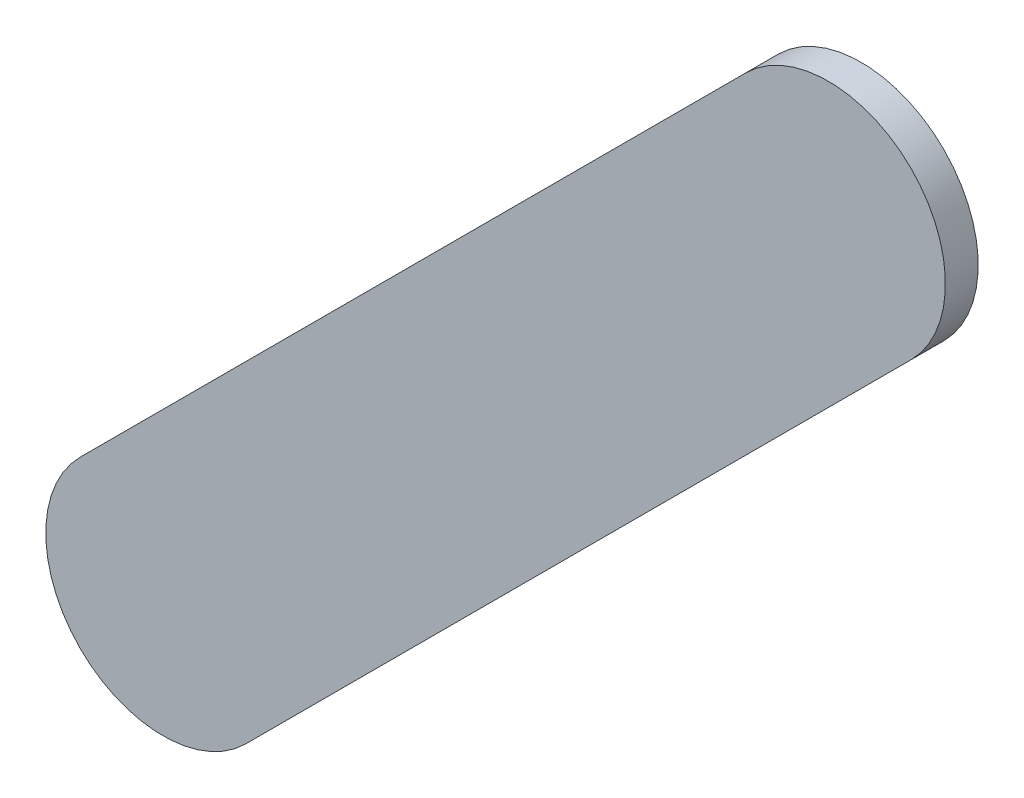
ISO-10303-21;
HEADER;
FILE_DESCRIPTION(('STEP AP214'),'2;1');
FILE_NAME('part.step','',(''),(''),'','','');
FILE_SCHEMA(('AUTOMOTIVE_DESIGN { 1 0 10303 214 1 1 1 1 }'));
ENDSEC;
DATA;
#1=APPLICATION_CONTEXT('core data for automotive mechanical design processes');
#2=APPLICATION_PROTOCOL_DEFINITION('international standard','automotive_design',2000,#1);
#3=PRODUCT_CONTEXT('',#1,'mechanical');
#4=PRODUCT('Part','Part','',(#3));
#5=PRODUCT_RELATED_PRODUCT_CATEGORY('part','',(#4));
#6=PRODUCT_DEFINITION_FORMATION('','',#4);
#7=PRODUCT_DEFINITION_CONTEXT('part definition',#1,'design');
#8=PRODUCT_DEFINITION('design','',#6,#7);
#9=PRODUCT_DEFINITION_SHAPE('','',#8);
#10=(LENGTH_UNIT() NAMED_UNIT(*) SI_UNIT(.MILLI.,.METRE.));
#11=(NAMED_UNIT(*) PLANE_ANGLE_UNIT() SI_UNIT($,.RADIAN.));
#12=(NAMED_UNIT(*) SI_UNIT($,.STERADIAN.) SOLID_ANGLE_UNIT());
#13=UNCERTAINTY_MEASURE_WITH_UNIT(LENGTH_MEASURE(1.E-05),#10,'distance_accuracy_value','');
#14=(GEOMETRIC_REPRESENTATION_CONTEXT(3) GLOBAL_UNCERTAINTY_ASSIGNED_CONTEXT((#13)) GLOBAL_UNIT_ASSIGNED_CONTEXT((#10,
#11,#12)) REPRESENTATION_CONTEXT('',''));
#15=CARTESIAN_POINT('',(0.,0.,0.));
#16=DIRECTION('',(0.,0.,1.));
#17=DIRECTION('',(1.,0.,0.));
#18=AXIS2_PLACEMENT_3D('',#15,#16,#17);
#19=CARTESIAN_POINT('',(96.28475028,57.12518674,0.));
#20=DIRECTION('',(-0.707108024981541,0.707105537389366,0.));
#21=DIRECTION('',(0.707105537389366,0.707108024981541,0.));
#22=AXIS2_PLACEMENT_3D('',#19,#20,#21);
#23=PLANE('',#22);
#24=DIRECTION('',(0.707105537389366,0.707108024981541,0.));
#25=VECTOR('',#24,1.);
#26=CARTESIAN_POINT('',(96.28475028,57.12518674,0.03556));
#27=LINE('',#26,#25);
#28=CARTESIAN_POINT('',(96.28475028,57.12518674,0.03556));
#29=VERTEX_POINT('',#28);
#30=CARTESIAN_POINT('',(97.0067529,57.8471919,0.03556));
#31=VERTEX_POINT('',#30);
#32=EDGE_CURVE('E11',#29,#31,#27,.T.);
#33=ORIENTED_EDGE('',*,*,#32,.F.);
#34=DIRECTION('',(0.,0.,1.));
#35=VECTOR('',#34,1.);
#36=CARTESIAN_POINT('',(96.28475028,57.12518674,0.));
#37=LINE('',#36,#35);
#38=CARTESIAN_POINT('',(96.28475028,57.12518674,0.));
#39=VERTEX_POINT('',#38);
#40=EDGE_CURVE('E24',#39,#29,#37,.T.);
#41=ORIENTED_EDGE('',*,*,#40,.F.);
#42=DIRECTION('',(0.707105537389366,0.707108024981541,0.));
#43=VECTOR('',#42,1.);
#44=CARTESIAN_POINT('',(96.28475028,57.12518674,0.));
#45=LINE('',#44,#43);
#46=CARTESIAN_POINT('',(97.0067529,57.8471919,0.));
#47=VERTEX_POINT('',#46);
#48=EDGE_CURVE('E75',#39,#47,#45,.T.);
#49=ORIENTED_EDGE('',*,*,#48,.T.);
#50=DIRECTION('',(0.,0.,1.));
#51=VECTOR('',#50,1.);
#52=CARTESIAN_POINT('',(97.0067529,57.8471919,0.));
#53=LINE('',#52,#51);
#54=EDGE_CURVE('E37',#47,#31,#53,.T.);
#55=ORIENTED_EDGE('',*,*,#54,.T.);
#56=EDGE_LOOP('',(#33,#41,#49,#55));
#57=FACE_BOUND('',#56,.T.);
#58=ADVANCED_FACE('F17',(#57),#23,.F.);
#59=CARTESIAN_POINT('',(96.9169512,57.9369936,0.));
#60=DIRECTION('',(0.,0.,-1.));
#61=DIRECTION('',(0.707106781186548,-0.707106781186548,0.));
#62=AXIS2_PLACEMENT_3D('',#59,#60,#61);
#63=CYLINDRICAL_SURFACE('',#62,0.126998782064157);
#64=CARTESIAN_POINT('',(96.9169512,57.9369936,0.03556));
#65=DIRECTION('',(0.,0.,1.));
#66=DIRECTION('',(0.707106781186548,-0.707106781186548,0.));
#67=AXIS2_PLACEMENT_3D('',#64,#65,#66);
#68=CIRCLE('',#67,0.126998782064157);
#69=CARTESIAN_POINT('',(96.8271495,58.0267953,0.03556));
#70=VERTEX_POINT('',#69);
#71=EDGE_CURVE('E83',#31,#70,#68,.T.);
#72=ORIENTED_EDGE('',*,*,#71,.F.);
#73=ORIENTED_EDGE('',*,*,#54,.F.);
#74=CARTESIAN_POINT('',(96.9169512,57.9369936,0.));
#75=DIRECTION('',(0.,0.,1.));
#76=DIRECTION('',(0.707106781186548,-0.707106781186548,0.));
#77=AXIS2_PLACEMENT_3D('',#74,#75,#76);
#78=CIRCLE('',#77,0.126998782064157);
#79=CARTESIAN_POINT('',(96.8271495,58.0267953,0.));
#80=VERTEX_POINT('',#79);
#81=EDGE_CURVE('E81',#47,#80,#78,.T.);
#82=ORIENTED_EDGE('',*,*,#81,.T.);
#83=DIRECTION('',(0.,0.,1.));
#84=VECTOR('',#83,1.);
#85=CARTESIAN_POINT('',(96.8271495,58.0267953,0.));
#86=LINE('',#85,#84);
#87=EDGE_CURVE('E67',#80,#70,#86,.T.);
#88=ORIENTED_EDGE('',*,*,#87,.T.);
#89=EDGE_LOOP('',(#72,#73,#82,#88));
#90=FACE_BOUND('',#89,.T.);
#91=ADVANCED_FACE('F89',(#90),#63,.T.);
#92=CARTESIAN_POINT('',(96.8271495,58.0267953,0.));
#93=DIRECTION('',(0.707105537389363,-0.707108024981545,0.));
#94=DIRECTION('',(-0.707108024981545,-0.707105537389363,0.));
#95=AXIS2_PLACEMENT_3D('',#92,#93,#94);
#96=PLANE('',#95);
#97=DIRECTION('',(-0.707108024981545,-0.707105537389363,0.));
#98=VECTOR('',#97,1.);
#99=CARTESIAN_POINT('',(96.8271495,58.0267953,0.03556));
#100=LINE('',#99,#98);
#101=CARTESIAN_POINT('',(96.10514434,57.30479268,0.03556));
#102=VERTEX_POINT('',#101);
#103=EDGE_CURVE('E71',#70,#102,#100,.T.);
#104=ORIENTED_EDGE('',*,*,#103,.F.);
#105=ORIENTED_EDGE('',*,*,#87,.F.);
#106=DIRECTION('',(-0.707108024981545,-0.707105537389363,0.));
#107=VECTOR('',#106,1.);
#108=CARTESIAN_POINT('',(96.8271495,58.0267953,0.));
#109=LINE('',#108,#107);
#110=CARTESIAN_POINT('',(96.10514434,57.30479268,0.));
#111=VERTEX_POINT('',#110);
#112=EDGE_CURVE('E63',#80,#111,#109,.T.);
#113=ORIENTED_EDGE('',*,*,#112,.T.);
#114=DIRECTION('',(0.,0.,1.));
#115=VECTOR('',#114,1.);
#116=CARTESIAN_POINT('',(96.10514434,57.30479268,0.));
#117=LINE('',#116,#115);
#118=EDGE_CURVE('E53',#111,#102,#117,.T.);
#119=ORIENTED_EDGE('',*,*,#118,.T.);
#120=EDGE_LOOP('',(#104,#105,#113,#119));
#121=FACE_BOUND('',#120,.T.);
#122=ADVANCED_FACE('F66',(#121),#96,.F.);
#123=CARTESIAN_POINT('',(96.19494731,57.21498971,0.));
#124=DIRECTION('',(0.,0.,-1.));
#125=DIRECTION('',(-0.707106781186576,0.70710678118652,0.));
#126=AXIS2_PLACEMENT_3D('',#123,#124,#125);
#127=CYLINDRICAL_SURFACE('',#126,0.127000578115387);
#128=CARTESIAN_POINT('',(96.19494731,57.21498971,0.03556));
#129=DIRECTION('',(0.,0.,1.));
#130=DIRECTION('',(-0.707106781186576,0.70710678118652,0.));
#131=AXIS2_PLACEMENT_3D('',#128,#129,#130);
#132=CIRCLE('',#131,0.127000578115387);
#133=EDGE_CURVE('E59',#102,#29,#132,.T.);
#134=ORIENTED_EDGE('',*,*,#133,.F.);
#135=ORIENTED_EDGE('',*,*,#118,.F.);
#136=CARTESIAN_POINT('',(96.19494731,57.21498971,0.));
#137=DIRECTION('',(0.,0.,1.));
#138=DIRECTION('',(-0.707106781186576,0.70710678118652,0.));
#139=AXIS2_PLACEMENT_3D('',#136,#137,#138);
#140=CIRCLE('',#139,0.127000578115387);
#141=EDGE_CURVE('E57',#111,#39,#140,.T.);
#142=ORIENTED_EDGE('',*,*,#141,.T.);
#143=ORIENTED_EDGE('',*,*,#40,.T.);
#144=EDGE_LOOP('',(#134,#135,#142,#143));
#145=FACE_BOUND('',#144,.T.);
#146=ADVANCED_FACE('F55',(#145),#127,.T.);
#147=CARTESIAN_POINT('',(96.28475028,57.12518674,0.));
#148=DIRECTION('',(0.,0.,-1.));
#149=DIRECTION('',(-1.,0.,0.));
#150=AXIS2_PLACEMENT_3D('',#147,#148,#149);
#151=PLANE('',#150);
#152=ORIENTED_EDGE('',*,*,#141,.F.);
#153=ORIENTED_EDGE('',*,*,#112,.F.);
#154=ORIENTED_EDGE('',*,*,#81,.F.);
#155=ORIENTED_EDGE('',*,*,#48,.F.);
#156=EDGE_LOOP('',(#152,#153,#154,#155));
#157=FACE_BOUND('',#156,.T.);
#158=ADVANCED_FACE('F74',(#157),#151,.T.);
#159=CARTESIAN_POINT('',(96.28475028,57.12518674,0.03556));
#160=DIRECTION('',(0.,0.,-1.));
#161=DIRECTION('',(-1.,0.,0.));
#162=AXIS2_PLACEMENT_3D('',#159,#160,#161);
#163=PLANE('',#162);
#164=ORIENTED_EDGE('',*,*,#32,.T.);
#165=ORIENTED_EDGE('',*,*,#71,.T.);
#166=ORIENTED_EDGE('',*,*,#103,.T.);
#167=ORIENTED_EDGE('',*,*,#133,.T.);
#168=EDGE_LOOP('',(#164,#165,#166,#167));
#169=FACE_BOUND('',#168,.T.);
#170=ADVANCED_FACE('F91',(#169),#163,.F.);
#171=CLOSED_SHELL('',(#58,#91,#122,#146,#158,#170));
#172=MANIFOLD_SOLID_BREP('B1',#171);
#173=ADVANCED_BREP_SHAPE_REPRESENTATION('',(#18,#172),#14);
#174=SHAPE_DEFINITION_REPRESENTATION(#9,#173);
ENDSEC;
END-ISO-10303-21;
